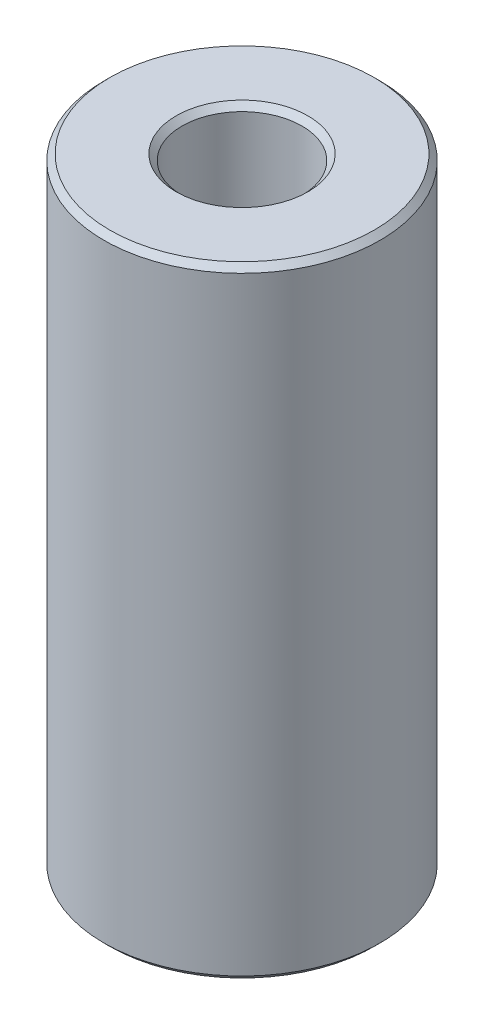
ISO-10303-21;
HEADER;
FILE_DESCRIPTION(('STEP AP214'),'2;1');
FILE_NAME('part.step','',(''),(''),'','','');
FILE_SCHEMA(('AUTOMOTIVE_DESIGN { 1 0 10303 214 1 1 1 1 }'));
ENDSEC;
DATA;
#1=APPLICATION_CONTEXT('core data for automotive mechanical design processes');
#2=APPLICATION_PROTOCOL_DEFINITION('international standard','automotive_design',2000,#1);
#3=PRODUCT_CONTEXT('',#1,'mechanical');
#4=PRODUCT('Part','Part','',(#3));
#5=PRODUCT_RELATED_PRODUCT_CATEGORY('part','',(#4));
#6=PRODUCT_DEFINITION_FORMATION('','',#4);
#7=PRODUCT_DEFINITION_CONTEXT('part definition',#1,'design');
#8=PRODUCT_DEFINITION('design','',#6,#7);
#9=PRODUCT_DEFINITION_SHAPE('','',#8);
#10=(LENGTH_UNIT() NAMED_UNIT(*) SI_UNIT(.MILLI.,.METRE.));
#11=(NAMED_UNIT(*) PLANE_ANGLE_UNIT() SI_UNIT($,.RADIAN.));
#12=(NAMED_UNIT(*) SI_UNIT($,.STERADIAN.) SOLID_ANGLE_UNIT());
#13=UNCERTAINTY_MEASURE_WITH_UNIT(LENGTH_MEASURE(1.E-05),#10,'distance_accuracy_value','');
#14=(GEOMETRIC_REPRESENTATION_CONTEXT(3) GLOBAL_UNCERTAINTY_ASSIGNED_CONTEXT((#13)) GLOBAL_UNIT_ASSIGNED_CONTEXT((#10,
#11,#12)) REPRESENTATION_CONTEXT('',''));
#15=CARTESIAN_POINT('',(0.,0.,0.));
#16=DIRECTION('',(0.,0.,1.));
#17=DIRECTION('',(1.,0.,0.));
#18=AXIS2_PLACEMENT_3D('',#15,#16,#17);
#19=CARTESIAN_POINT('',(0.,258.338370243015,0.));
#20=DIRECTION('',(0.,-1.,0.));
#21=DIRECTION('',(0.,0.,-1.));
#22=AXIS2_PLACEMENT_3D('',#19,#20,#21);
#23=CYLINDRICAL_SURFACE('',#22,57.5);
#24=CARTESIAN_POINT('',(0.,2.45121526824038,0.));
#25=DIRECTION('',(0.,1.,0.));
#26=DIRECTION('',(0.,0.,1.));
#27=AXIS2_PLACEMENT_3D('',#24,#25,#26);
#28=CIRCLE('',#27,57.5);
#29=CARTESIAN_POINT('',(0.,2.45121526824038,-57.5));
#30=VERTEX_POINT('',#29);
#31=EDGE_CURVE('E10',#30,#30,#28,.T.);
#32=CARTESIAN_POINT('',(0.,255.887154974775,0.));
#33=DIRECTION('',(0.,1.,0.));
#34=DIRECTION('',(0.,0.,1.));
#35=AXIS2_PLACEMENT_3D('',#32,#33,#34);
#36=CIRCLE('',#35,57.5);
#37=CARTESIAN_POINT('',(0.,255.887154974775,-57.5));
#38=VERTEX_POINT('',#37);
#39=EDGE_CURVE('E50',#38,#38,#36,.F.);
#40=CARTESIAN_POINT('',(0.,2.45121526824038,-57.5));
#41=CARTESIAN_POINT('',(0.,5.09117297351677,-57.5));
#42=CARTESIAN_POINT('',(0.,7.73113067879316,-57.5));
#43=CARTESIAN_POINT('',(0.,13.011046089346,-57.5));
#44=CARTESIAN_POINT('',(0.,15.6510037946224,-57.5));
#45=CARTESIAN_POINT('',(0.,20.9309192051752,-57.5));
#46=CARTESIAN_POINT('',(0.,23.5708769104516,-57.5));
#47=CARTESIAN_POINT('',(0.,28.8507923210044,-57.5));
#48=CARTESIAN_POINT('',(0.,31.4907500262808,-57.5));
#49=CARTESIAN_POINT('',(0.,36.7706654368336,-57.5));
#50=CARTESIAN_POINT('',(0.,39.41062314211,-57.5));
#51=CARTESIAN_POINT('',(0.,44.6905385526628,-57.5));
#52=CARTESIAN_POINT('',(0.,47.3304962579392,-57.5));
#53=CARTESIAN_POINT('',(0.,52.610411668492,-57.5));
#54=CARTESIAN_POINT('',(0.,55.2503693737684,-57.5));
#55=CARTESIAN_POINT('',(0.,60.5302847843213,-57.5));
#56=CARTESIAN_POINT('',(0.,63.1702424895977,-57.5));
#57=CARTESIAN_POINT('',(0.,68.4501579001505,-57.5));
#58=CARTESIAN_POINT('',(0.,71.0901156054269,-57.5));
#59=CARTESIAN_POINT('',(0.,76.3700310159797,-57.5));
#60=CARTESIAN_POINT('',(0.,79.0099887212561,-57.5));
#61=CARTESIAN_POINT('',(0.,84.2899041318089,-57.5));
#62=CARTESIAN_POINT('',(0.,86.9298618370853,-57.5));
#63=CARTESIAN_POINT('',(0.,92.2097772476381,-57.5));
#64=CARTESIAN_POINT('',(0.,94.8497349529145,-57.5));
#65=CARTESIAN_POINT('',(0.,100.129650363467,-57.5));
#66=CARTESIAN_POINT('',(0.,102.769608068744,-57.5));
#67=CARTESIAN_POINT('',(0.,108.049523479297,-57.5));
#68=CARTESIAN_POINT('',(0.,110.689481184573,-57.5));
#69=CARTESIAN_POINT('',(0.,115.969396595126,-57.5));
#70=CARTESIAN_POINT('',(0.,118.609354300402,-57.5));
#71=CARTESIAN_POINT('',(0.,123.889269710955,-57.5));
#72=CARTESIAN_POINT('',(0.,126.529227416231,-57.5));
#73=CARTESIAN_POINT('',(0.,131.809142826784,-57.5));
#74=CARTESIAN_POINT('',(0.,134.449100532061,-57.5));
#75=CARTESIAN_POINT('',(0.,139.729015942613,-57.5));
#76=CARTESIAN_POINT('',(0.,142.36897364789,-57.5));
#77=CARTESIAN_POINT('',(0.,147.648889058443,-57.5));
#78=CARTESIAN_POINT('',(0.,150.288846763719,-57.5));
#79=CARTESIAN_POINT('',(0.,155.568762174272,-57.5));
#80=CARTESIAN_POINT('',(0.,158.208719879548,-57.5));
#81=CARTESIAN_POINT('',(0.,163.488635290101,-57.5));
#82=CARTESIAN_POINT('',(0.,166.128592995377,-57.5));
#83=CARTESIAN_POINT('',(0.,171.40850840593,-57.5));
#84=CARTESIAN_POINT('',(0.,174.048466111207,-57.5));
#85=CARTESIAN_POINT('',(0.,179.328381521759,-57.5));
#86=CARTESIAN_POINT('',(0.,181.968339227036,-57.5));
#87=CARTESIAN_POINT('',(0.,187.248254637589,-57.5));
#88=CARTESIAN_POINT('',(0.,189.888212342865,-57.5));
#89=CARTESIAN_POINT('',(0.,195.168127753418,-57.5));
#90=CARTESIAN_POINT('',(0.,197.808085458694,-57.5));
#91=CARTESIAN_POINT('',(0.,203.088000869247,-57.5));
#92=CARTESIAN_POINT('',(0.,205.727958574523,-57.5));
#93=CARTESIAN_POINT('',(0.,211.007873985076,-57.5));
#94=CARTESIAN_POINT('',(0.,213.647831690353,-57.5));
#95=CARTESIAN_POINT('',(0.,218.927747100905,-57.5));
#96=CARTESIAN_POINT('',(0.,221.567704806182,-57.5));
#97=CARTESIAN_POINT('',(0.,226.847620216735,-57.5));
#98=CARTESIAN_POINT('',(0.,229.487577922011,-57.5));
#99=CARTESIAN_POINT('',(0.,234.767493332564,-57.5));
#100=CARTESIAN_POINT('',(0.,237.40745103784,-57.5));
#101=CARTESIAN_POINT('',(0.,242.687366448393,-57.5));
#102=CARTESIAN_POINT('',(0.,245.32732415367,-57.5));
#103=CARTESIAN_POINT('',(0.,250.607239564222,-57.5));
#104=CARTESIAN_POINT('',(0.,253.247197269499,-57.5));
#105=CARTESIAN_POINT('',(0.,255.887154974775,-57.5));
#106=B_SPLINE_CURVE_WITH_KNOTS('',3,(#40,#41,#42,#43,#44,#45,#46,#47,#48,#49,#50,#51,#52,#53,
#54,#55,#56,#57,#58,#59,#60,#61,#62,#63,#64,#65,#66,#67,#68,#69,#70,#71,#72,#73,#74,#75,#76,#77,
#78,#79,#80,#81,#82,#83,#84,#85,#86,#87,#88,#89,#90,#91,#92,#93,#94,#95,#96,#97,#98,#99,#100,
#101,#102,#103,#104,#105),.UNSPECIFIED.,.F.,.F.,(4,2,2,2,2,2,2,2,2,2,2,2,2,2,2,2,2,2,2,2,2,2,2,
2,2,2,2,2,2,2,2,2,4),(0.,7.91987311582917,15.8397462316584,23.7596193474876,31.6794924633168,
39.599365579146,47.5192386949752,55.4391118108045,63.3589849266337,71.2788580424629,
79.1987311582921,87.1186042741213,95.0384773899505,102.95835050578,110.878223621609,
118.798096737438,126.717969853267,134.637842969097,142.557716084926,150.477589200755,
158.397462316584,166.317335432413,174.237208548243,182.157081664072,190.076954779901,
197.99682789573,205.916701011559,213.836574127389,221.756447243218,229.676320359047,
237.596193474876,245.516066590706,253.435939706535),.UNSPECIFIED.);
#107=EDGE_CURVE('BSEAM39',#30,#38,#106,.T.);
#108=ORIENTED_EDGE('',*,*,#31,.T.);
#109=ORIENTED_EDGE('',*,*,#39,.T.);
#110=ORIENTED_EDGE('',*,*,#107,.T.);
#111=ORIENTED_EDGE('',*,*,#107,.F.);
#112=EDGE_LOOP('',(#108,#110,#109,#111));
#113=FACE_BOUND('',#112,.T.);
#114=ADVANCED_FACE('F39',(#113),#23,.T.);
#115=CARTESIAN_POINT('',(0.,258.338370243015,0.));
#116=DIRECTION('',(0.,1.,0.));
#117=DIRECTION('',(0.,0.,1.));
#118=AXIS2_PLACEMENT_3D('',#115,#116,#117);
#119=PLANE('',#118);
#120=CARTESIAN_POINT('',(0.,258.338370243015,0.));
#121=DIRECTION('',(0.,1.,0.));
#122=DIRECTION('',(0.,0.,1.));
#123=AXIS2_PLACEMENT_3D('',#120,#121,#122);
#124=CIRCLE('',#123,27.4388798643397);
#125=CARTESIAN_POINT('',(0.,258.338370243015,27.4388798643397));
#126=VERTEX_POINT('',#125);
#127=EDGE_CURVE('E58',#126,#126,#124,.F.);
#128=ORIENTED_EDGE('',*,*,#127,.T.);
#129=EDGE_LOOP('',(#128));
#130=FACE_BOUND('',#129,.T.);
#131=CARTESIAN_POINT('',(0.,258.338370243015,0.));
#132=DIRECTION('',(0.,1.,0.));
#133=DIRECTION('',(0.,0.,1.));
#134=AXIS2_PLACEMENT_3D('',#131,#132,#133);
#135=CIRCLE('',#134,55.04878473176);
#136=CARTESIAN_POINT('',(0.,258.338370243015,55.04878473176));
#137=VERTEX_POINT('',#136);
#138=EDGE_CURVE('E61',#137,#137,#135,.T.);
#139=ORIENTED_EDGE('',*,*,#138,.T.);
#140=EDGE_LOOP('',(#139));
#141=FACE_BOUND('',#140,.T.);
#142=ADVANCED_FACE('F88',(#130,#141),#119,.T.);
#143=CARTESIAN_POINT('',(0.,0.,0.));
#144=DIRECTION('',(0.,1.,0.));
#145=DIRECTION('',(0.,0.,1.));
#146=AXIS2_PLACEMENT_3D('',#143,#144,#145);
#147=PLANE('',#146);
#148=CARTESIAN_POINT('',(0.,0.,0.));
#149=DIRECTION('',(0.,1.,0.));
#150=DIRECTION('',(0.,0.,1.));
#151=AXIS2_PLACEMENT_3D('',#148,#149,#150);
#152=CIRCLE('',#151,27.4388798643394);
#153=CARTESIAN_POINT('',(0.,0.,27.4388798643394));
#154=VERTEX_POINT('',#153);
#155=EDGE_CURVE('E51',#154,#154,#152,.T.);
#156=ORIENTED_EDGE('',*,*,#155,.T.);
#157=EDGE_LOOP('',(#156));
#158=FACE_BOUND('',#157,.T.);
#159=CARTESIAN_POINT('',(0.,0.,0.));
#160=DIRECTION('',(0.,1.,0.));
#161=DIRECTION('',(0.,0.,1.));
#162=AXIS2_PLACEMENT_3D('',#159,#160,#161);
#163=CIRCLE('',#162,55.0487847317596);
#164=CARTESIAN_POINT('',(0.,0.,55.0487847317596));
#165=VERTEX_POINT('',#164);
#166=EDGE_CURVE('E54',#165,#165,#163,.F.);
#167=ORIENTED_EDGE('',*,*,#166,.T.);
#168=EDGE_LOOP('',(#167));
#169=FACE_BOUND('',#168,.T.);
#170=ADVANCED_FACE('F83',(#158,#169),#147,.F.);
#171=CARTESIAN_POINT('',(0.,258.338370243015,0.));
#172=DIRECTION('',(0.,-1.,0.));
#173=DIRECTION('',(0.,0.,-1.));
#174=AXIS2_PLACEMENT_3D('',#171,#172,#173);
#175=CYLINDRICAL_SURFACE('',#174,24.9876645960993);
#176=CARTESIAN_POINT('',(0.,255.887154974775,0.));
#177=DIRECTION('',(0.,1.,0.));
#178=DIRECTION('',(0.,0.,1.));
#179=AXIS2_PLACEMENT_3D('',#176,#177,#178);
#180=CIRCLE('',#179,24.9876645960993);
#181=CARTESIAN_POINT('',(0.,255.887154974775,-24.9876645960993));
#182=VERTEX_POINT('',#181);
#183=EDGE_CURVE('E67',#182,#182,#180,.T.);
#184=CARTESIAN_POINT('',(0.,2.45121526824021,0.));
#185=DIRECTION('',(0.,1.,0.));
#186=DIRECTION('',(0.,0.,1.));
#187=AXIS2_PLACEMENT_3D('',#184,#185,#186);
#188=CIRCLE('',#187,24.9876645960993);
#189=CARTESIAN_POINT('',(0.,2.45121526824016,-24.9876645960993));
#190=VERTEX_POINT('',#189);
#191=EDGE_CURVE('E69',#190,#190,#188,.F.);
#192=CARTESIAN_POINT('',(0.,255.887154974775,-24.9876645960993));
#193=CARTESIAN_POINT('',(0.,253.247197269498,-24.9876645960993));
#194=CARTESIAN_POINT('',(0.,250.607239564222,-24.9876645960993));
#195=CARTESIAN_POINT('',(0.,245.327324153669,-24.9876645960993));
#196=CARTESIAN_POINT('',(0.,242.687366448393,-24.9876645960993));
#197=CARTESIAN_POINT('',(0.,237.40745103784,-24.9876645960993));
#198=CARTESIAN_POINT('',(0.,234.767493332564,-24.9876645960993));
#199=CARTESIAN_POINT('',(0.,229.487577922011,-24.9876645960993));
#200=CARTESIAN_POINT('',(0.,226.847620216734,-24.9876645960993));
#201=CARTESIAN_POINT('',(0.,221.567704806182,-24.9876645960993));
#202=CARTESIAN_POINT('',(0.,218.927747100905,-24.9876645960993));
#203=CARTESIAN_POINT('',(0.,213.647831690352,-24.9876645960993));
#204=CARTESIAN_POINT('',(0.,211.007873985076,-24.9876645960993));
#205=CARTESIAN_POINT('',(0.,205.727958574523,-24.9876645960993));
#206=CARTESIAN_POINT('',(0.,203.088000869247,-24.9876645960993));
#207=CARTESIAN_POINT('',(0.,197.808085458694,-24.9876645960993));
#208=CARTESIAN_POINT('',(0.,195.168127753417,-24.9876645960993));
#209=CARTESIAN_POINT('',(0.,189.888212342865,-24.9876645960993));
#210=CARTESIAN_POINT('',(0.,187.248254637588,-24.9876645960993));
#211=CARTESIAN_POINT('',(0.,181.968339227036,-24.9876645960993));
#212=CARTESIAN_POINT('',(0.,179.328381521759,-24.9876645960993));
#213=CARTESIAN_POINT('',(0.,174.048466111206,-24.9876645960993));
#214=CARTESIAN_POINT('',(0.,171.40850840593,-24.9876645960993));
#215=CARTESIAN_POINT('',(0.,166.128592995377,-24.9876645960993));
#216=CARTESIAN_POINT('',(0.,163.488635290101,-24.9876645960993));
#217=CARTESIAN_POINT('',(0.,158.208719879548,-24.9876645960993));
#218=CARTESIAN_POINT('',(0.,155.568762174271,-24.9876645960993));
#219=CARTESIAN_POINT('',(0.,150.288846763719,-24.9876645960993));
#220=CARTESIAN_POINT('',(0.,147.648889058442,-24.9876645960993));
#221=CARTESIAN_POINT('',(0.,142.368973647889,-24.9876645960993));
#222=CARTESIAN_POINT('',(0.,139.729015942613,-24.9876645960993));
#223=CARTESIAN_POINT('',(0.,134.44910053206,-24.9876645960993));
#224=CARTESIAN_POINT('',(0.,131.809142826784,-24.9876645960993));
#225=CARTESIAN_POINT('',(0.,126.529227416231,-24.9876645960993));
#226=CARTESIAN_POINT('',(0.,123.889269710955,-24.9876645960993));
#227=CARTESIAN_POINT('',(0.,118.609354300402,-24.9876645960993));
#228=CARTESIAN_POINT('',(0.,115.969396595125,-24.9876645960993));
#229=CARTESIAN_POINT('',(0.,110.689481184573,-24.9876645960993));
#230=CARTESIAN_POINT('',(0.,108.049523479296,-24.9876645960993));
#231=CARTESIAN_POINT('',(0.,102.769608068743,-24.9876645960993));
#232=CARTESIAN_POINT('',(0.,100.129650363467,-24.9876645960993));
#233=CARTESIAN_POINT('',(0.,94.8497349529142,-24.9876645960993));
#234=CARTESIAN_POINT('',(0.,92.2097772476378,-24.9876645960993));
#235=CARTESIAN_POINT('',(0.,86.929861837085,-24.9876645960993));
#236=CARTESIAN_POINT('',(0.,84.2899041318086,-24.9876645960993));
#237=CARTESIAN_POINT('',(0.,79.0099887212558,-24.9876645960993));
#238=CARTESIAN_POINT('',(0.,76.3700310159794,-24.9876645960993));
#239=CARTESIAN_POINT('',(0.,71.0901156054266,-24.9876645960993));
#240=CARTESIAN_POINT('',(0.,68.4501579001502,-24.9876645960993));
#241=CARTESIAN_POINT('',(0.,63.1702424895974,-24.9876645960993));
#242=CARTESIAN_POINT('',(0.,60.530284784321,-24.9876645960993));
#243=CARTESIAN_POINT('',(0.,55.2503693737682,-24.9876645960993));
#244=CARTESIAN_POINT('',(0.,52.6104116684918,-24.9876645960993));
#245=CARTESIAN_POINT('',(0.,47.330496257939,-24.9876645960993));
#246=CARTESIAN_POINT('',(0.,44.6905385526626,-24.9876645960993));
#247=CARTESIAN_POINT('',(0.,39.4106231421098,-24.9876645960993));
#248=CARTESIAN_POINT('',(0.,36.7706654368334,-24.9876645960993));
#249=CARTESIAN_POINT('',(0.,31.4907500262806,-24.9876645960993));
#250=CARTESIAN_POINT('',(0.,28.8507923210042,-24.9876645960993));
#251=CARTESIAN_POINT('',(0.,23.5708769104514,-24.9876645960993));
#252=CARTESIAN_POINT('',(0.,20.930919205175,-24.9876645960993));
#253=CARTESIAN_POINT('',(0.,15.6510037946222,-24.9876645960993));
#254=CARTESIAN_POINT('',(0.,13.0110460893458,-24.9876645960993));
#255=CARTESIAN_POINT('',(0.,7.73113067879296,-24.9876645960993));
#256=CARTESIAN_POINT('',(0.,5.09117297351656,-24.9876645960993));
#257=CARTESIAN_POINT('',(0.,2.45121526824016,-24.9876645960993));
#258=B_SPLINE_CURVE_WITH_KNOTS('',3,(#192,#193,#194,#195,#196,#197,#198,#199,#200,#201,#202,
#203,#204,#205,#206,#207,#208,#209,#210,#211,#212,#213,#214,#215,#216,#217,#218,#219,#220,#221,
#222,#223,#224,#225,#226,#227,#228,#229,#230,#231,#232,#233,#234,#235,#236,#237,#238,#239,#240,
#241,#242,#243,#244,#245,#246,#247,#248,#249,#250,#251,#252,#253,#254,#255,#256,#257),
.UNSPECIFIED.,.F.,.F.,(4,2,2,2,2,2,2,2,2,2,2,2,2,2,2,2,2,2,2,2,2,2,2,2,2,2,2,2,2,2,2,2,4),(0.,
7.91987311582917,15.8397462316584,23.7596193474876,31.6794924633168,39.599365579146,
47.5192386949752,55.4391118108044,63.3589849266336,71.2788580424628,79.198731158292,
87.1186042741212,95.0384773899504,102.95835050578,110.878223621609,118.798096737438,
126.717969853267,134.637842969096,142.557716084926,150.477589200755,158.397462316584,
166.317335432413,174.237208548242,182.157081664072,190.076954779901,197.99682789573,
205.916701011559,213.836574127389,221.756447243218,229.676320359047,237.596193474876,
245.516066590705,253.435939706535),.UNSPECIFIED.);
#259=EDGE_CURVE('BSEAM71',#182,#190,#258,.T.);
#260=ORIENTED_EDGE('',*,*,#183,.T.);
#261=ORIENTED_EDGE('',*,*,#191,.T.);
#262=ORIENTED_EDGE('',*,*,#259,.T.);
#263=ORIENTED_EDGE('',*,*,#259,.F.);
#264=EDGE_LOOP('',(#260,#262,#261,#263));
#265=FACE_BOUND('',#264,.T.);
#266=ADVANCED_FACE('F71',(#265),#175,.F.);
#267=CARTESIAN_POINT('',(0.,255.887154974775,0.));
#268=DIRECTION('',(0.,1.,0.));
#269=DIRECTION('',(0.,0.,1.));
#270=AXIS2_PLACEMENT_3D('',#267,#268,#269);
#271=CONICAL_SURFACE('',#270,24.9876645960993,0.785398163397443);
#272=ORIENTED_EDGE('',*,*,#127,.F.);
#273=EDGE_LOOP('',(#272));
#274=FACE_BOUND('',#273,.T.);
#275=ORIENTED_EDGE('',*,*,#183,.F.);
#276=EDGE_LOOP('',(#275));
#277=FACE_BOUND('',#276,.T.);
#278=ADVANCED_FACE('F77',(#274,#277),#271,.F.);
#279=CARTESIAN_POINT('',(0.,0.,0.));
#280=DIRECTION('',(0.,-1.,0.));
#281=DIRECTION('',(0.,0.,-1.));
#282=AXIS2_PLACEMENT_3D('',#279,#280,#281);
#283=CONICAL_SURFACE('',#282,27.4388798643394,0.785398163397438);
#284=ORIENTED_EDGE('',*,*,#191,.F.);
#285=EDGE_LOOP('',(#284));
#286=FACE_BOUND('',#285,.T.);
#287=ORIENTED_EDGE('',*,*,#155,.F.);
#288=EDGE_LOOP('',(#287));
#289=FACE_BOUND('',#288,.T.);
#290=ADVANCED_FACE('F73',(#286,#289),#283,.F.);
#291=CARTESIAN_POINT('',(0.,2.45121526824038,0.));
#292=DIRECTION('',(0.,1.,0.));
#293=DIRECTION('',(0.,0.,1.));
#294=AXIS2_PLACEMENT_3D('',#291,#292,#293);
#295=CONICAL_SURFACE('',#294,57.5,0.785398163397451);
#296=ORIENTED_EDGE('',*,*,#166,.F.);
#297=EDGE_LOOP('',(#296));
#298=FACE_BOUND('',#297,.T.);
#299=ORIENTED_EDGE('',*,*,#31,.F.);
#300=EDGE_LOOP('',(#299));
#301=FACE_BOUND('',#300,.T.);
#302=ADVANCED_FACE('F76',(#298,#301),#295,.T.);
#303=CARTESIAN_POINT('',(0.,258.338370243015,0.));
#304=DIRECTION('',(0.,-1.,0.));
#305=DIRECTION('',(0.,0.,-1.));
#306=AXIS2_PLACEMENT_3D('',#303,#304,#305);
#307=CONICAL_SURFACE('',#306,55.04878473176,0.785398163397457);
#308=ORIENTED_EDGE('',*,*,#39,.F.);
#309=EDGE_LOOP('',(#308));
#310=FACE_BOUND('',#309,.T.);
#311=ORIENTED_EDGE('',*,*,#138,.F.);
#312=EDGE_LOOP('',(#311));
#313=FACE_BOUND('',#312,.T.);
#314=ADVANCED_FACE('F45',(#310,#313),#307,.T.);
#315=CLOSED_SHELL('',(#114,#142,#170,#266,#278,#290,#302,#314));
#316=MANIFOLD_SOLID_BREP('B2',#315);
#317=ADVANCED_BREP_SHAPE_REPRESENTATION('',(#18,#316),#14);
#318=SHAPE_DEFINITION_REPRESENTATION(#9,#317);
ENDSEC;
END-ISO-10303-21;
